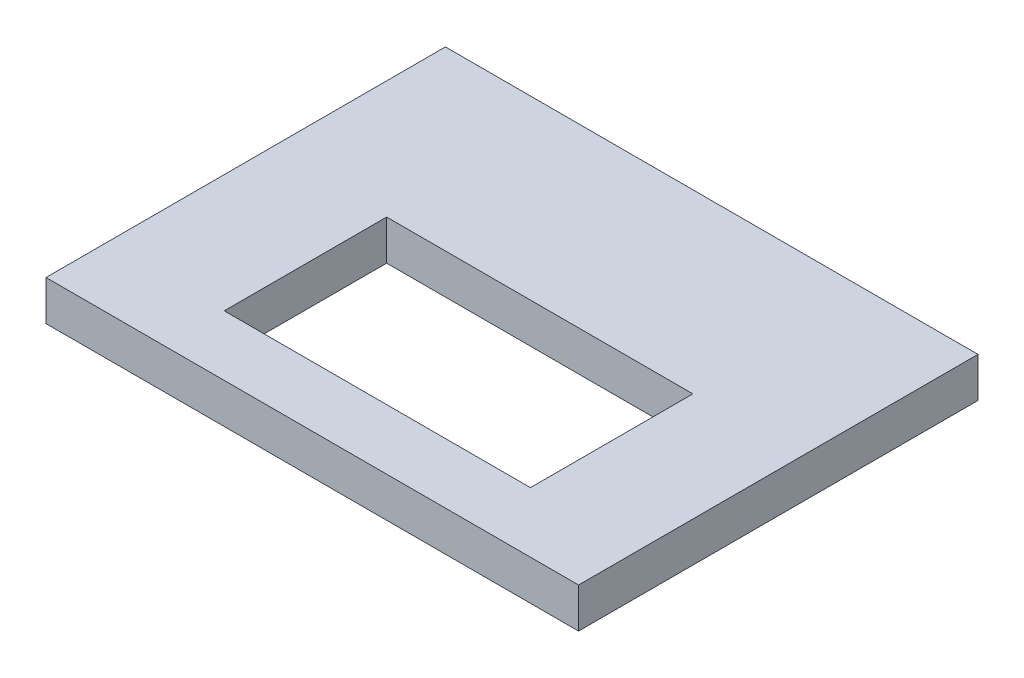
ISO-10303-21;
HEADER;
FILE_DESCRIPTION(('STEP AP214'),'2;1');
FILE_NAME('part.step','',(''),(''),'','','');
FILE_SCHEMA(('AUTOMOTIVE_DESIGN { 1 0 10303 214 1 1 1 1 }'));
ENDSEC;
DATA;
#1=APPLICATION_CONTEXT('core data for automotive mechanical design processes');
#2=APPLICATION_PROTOCOL_DEFINITION('international standard','automotive_design',2000,#1);
#3=PRODUCT_CONTEXT('',#1,'mechanical');
#4=PRODUCT('Part','Part','',(#3));
#5=PRODUCT_RELATED_PRODUCT_CATEGORY('part','',(#4));
#6=PRODUCT_DEFINITION_FORMATION('','',#4);
#7=PRODUCT_DEFINITION_CONTEXT('part definition',#1,'design');
#8=PRODUCT_DEFINITION('design','',#6,#7);
#9=PRODUCT_DEFINITION_SHAPE('','',#8);
#10=(LENGTH_UNIT() NAMED_UNIT(*) SI_UNIT(.MILLI.,.METRE.));
#11=(NAMED_UNIT(*) PLANE_ANGLE_UNIT() SI_UNIT($,.RADIAN.));
#12=(NAMED_UNIT(*) SI_UNIT($,.STERADIAN.) SOLID_ANGLE_UNIT());
#13=UNCERTAINTY_MEASURE_WITH_UNIT(LENGTH_MEASURE(1.E-05),#10,'distance_accuracy_value','');
#14=(GEOMETRIC_REPRESENTATION_CONTEXT(3) GLOBAL_UNCERTAINTY_ASSIGNED_CONTEXT((#13)) GLOBAL_UNIT_ASSIGNED_CONTEXT((#10,
#11,#12)) REPRESENTATION_CONTEXT('',''));
#15=CARTESIAN_POINT('',(0.,0.,0.));
#16=DIRECTION('',(0.,0.,1.));
#17=DIRECTION('',(1.,0.,0.));
#18=AXIS2_PLACEMENT_3D('',#15,#16,#17);
#19=CARTESIAN_POINT('',(0.,3.,0.));
#20=DIRECTION('',(0.,1.,0.));
#21=DIRECTION('',(0.,0.,1.));
#22=AXIS2_PLACEMENT_3D('',#19,#20,#21);
#23=PLANE('',#22);
#24=DIRECTION('',(0.,0.,1.));
#25=VECTOR('',#24,1.);
#26=CARTESIAN_POINT('',(-55.8757652811462,3.,-14.368398637138));
#27=LINE('',#26,#25);
#28=CARTESIAN_POINT('',(-55.8757652811462,3.,-14.368398637138));
#29=VERTEX_POINT('',#28);
#30=CARTESIAN_POINT('',(-55.8757652811462,3.,15.631601362862));
#31=VERTEX_POINT('',#30);
#32=EDGE_CURVE('E134',#29,#31,#27,.T.);
#33=ORIENTED_EDGE('',*,*,#32,.T.);
#34=DIRECTION('',(1.,0.,0.));
#35=VECTOR('',#34,1.);
#36=CARTESIAN_POINT('',(-55.8757652811462,3.,15.631601362862));
#37=LINE('',#36,#35);
#38=CARTESIAN_POINT('',(-15.8757652811462,3.,15.631601362862));
#39=VERTEX_POINT('',#38);
#40=EDGE_CURVE('E137',#31,#39,#37,.T.);
#41=ORIENTED_EDGE('',*,*,#40,.T.);
#42=DIRECTION('',(0.,0.,-1.));
#43=VECTOR('',#42,1.);
#44=CARTESIAN_POINT('',(-15.8757652811462,3.,-14.368398637138));
#45=LINE('',#44,#43);
#46=CARTESIAN_POINT('',(-15.8757652811462,3.,-14.368398637138));
#47=VERTEX_POINT('',#46);
#48=EDGE_CURVE('E140',#39,#47,#45,.T.);
#49=ORIENTED_EDGE('',*,*,#48,.T.);
#50=DIRECTION('',(-1.,0.,0.));
#51=VECTOR('',#50,1.);
#52=CARTESIAN_POINT('',(-55.8757652811462,3.,-14.368398637138));
#53=LINE('',#52,#51);
#54=EDGE_CURVE('E142',#47,#29,#53,.T.);
#55=ORIENTED_EDGE('',*,*,#54,.T.);
#56=EDGE_LOOP('',(#33,#41,#49,#55));
#57=FACE_BOUND('',#56,.T.);
#58=DIRECTION('',(1.,0.,0.));
#59=VECTOR('',#58,1.);
#60=CARTESIAN_POINT('',(-47.0150352058024,3.,11.1067887587507));
#61=LINE('',#60,#59);
#62=CARTESIAN_POINT('',(-47.0150352058024,3.,11.1067887587507));
#63=VERTEX_POINT('',#62);
#64=CARTESIAN_POINT('',(-24.0150352058024,3.,11.1067887587507));
#65=VERTEX_POINT('',#64);
#66=EDGE_CURVE('E106',#63,#65,#61,.T.);
#67=ORIENTED_EDGE('',*,*,#66,.F.);
#68=DIRECTION('',(0.,0.,1.));
#69=VECTOR('',#68,1.);
#70=CARTESIAN_POINT('',(-47.0150352058024,3.,-1.09321124124927));
#71=LINE('',#70,#69);
#72=CARTESIAN_POINT('',(-47.0150352058024,3.,-1.09321124124927));
#73=VERTEX_POINT('',#72);
#74=EDGE_CURVE('E98',#73,#63,#71,.T.);
#75=ORIENTED_EDGE('',*,*,#74,.F.);
#76=DIRECTION('',(-1.,0.,0.));
#77=VECTOR('',#76,1.);
#78=CARTESIAN_POINT('',(-47.0150352058024,3.,-1.09321124124927));
#79=LINE('',#78,#77);
#80=CARTESIAN_POINT('',(-24.0150352058024,3.,-1.09321124124927));
#81=VERTEX_POINT('',#80);
#82=EDGE_CURVE('E120',#81,#73,#79,.T.);
#83=ORIENTED_EDGE('',*,*,#82,.F.);
#84=DIRECTION('',(0.,0.,-1.));
#85=VECTOR('',#84,1.);
#86=CARTESIAN_POINT('',(-24.0150352058024,3.,-1.09321124124927));
#87=LINE('',#86,#85);
#88=EDGE_CURVE('E118',#65,#81,#87,.T.);
#89=ORIENTED_EDGE('',*,*,#88,.F.);
#90=EDGE_LOOP('',(#67,#75,#83,#89));
#91=FACE_BOUND('',#90,.T.);
#92=ADVANCED_FACE('F33',(#57,#91),#23,.T.);
#93=CARTESIAN_POINT('',(0.,0.,0.));
#94=DIRECTION('',(0.,1.,0.));
#95=DIRECTION('',(0.,0.,1.));
#96=AXIS2_PLACEMENT_3D('',#93,#94,#95);
#97=PLANE('',#96);
#98=DIRECTION('',(0.,0.,1.));
#99=VECTOR('',#98,1.);
#100=CARTESIAN_POINT('',(-55.8757652811462,0.,-14.368398637138));
#101=LINE('',#100,#99);
#102=CARTESIAN_POINT('',(-55.8757652811462,0.,-14.368398637138));
#103=VERTEX_POINT('',#102);
#104=CARTESIAN_POINT('',(-55.8757652811462,0.,15.631601362862));
#105=VERTEX_POINT('',#104);
#106=EDGE_CURVE('E114',#103,#105,#101,.T.);
#107=ORIENTED_EDGE('',*,*,#106,.F.);
#108=DIRECTION('',(-1.,0.,0.));
#109=VECTOR('',#108,1.);
#110=CARTESIAN_POINT('',(-55.8757652811462,0.,-14.368398637138));
#111=LINE('',#110,#109);
#112=CARTESIAN_POINT('',(-15.8757652811462,0.,-14.368398637138));
#113=VERTEX_POINT('',#112);
#114=EDGE_CURVE('E138',#113,#103,#111,.T.);
#115=ORIENTED_EDGE('',*,*,#114,.F.);
#116=DIRECTION('',(0.,0.,-1.));
#117=VECTOR('',#116,1.);
#118=CARTESIAN_POINT('',(-15.8757652811462,0.,-14.368398637138));
#119=LINE('',#118,#117);
#120=CARTESIAN_POINT('',(-15.8757652811462,0.,15.631601362862));
#121=VERTEX_POINT('',#120);
#122=EDGE_CURVE('E149',#121,#113,#119,.T.);
#123=ORIENTED_EDGE('',*,*,#122,.F.);
#124=DIRECTION('',(1.,0.,0.));
#125=VECTOR('',#124,1.);
#126=CARTESIAN_POINT('',(-55.8757652811462,0.,15.631601362862));
#127=LINE('',#126,#125);
#128=EDGE_CURVE('E147',#105,#121,#127,.T.);
#129=ORIENTED_EDGE('',*,*,#128,.F.);
#130=EDGE_LOOP('',(#107,#115,#123,#129));
#131=FACE_BOUND('',#130,.T.);
#132=DIRECTION('',(0.,0.,1.));
#133=VECTOR('',#132,1.);
#134=CARTESIAN_POINT('',(-47.0150352058024,0.,-1.09321124124927));
#135=LINE('',#134,#133);
#136=CARTESIAN_POINT('',(-47.0150352058024,0.,-1.09321124124927));
#137=VERTEX_POINT('',#136);
#138=CARTESIAN_POINT('',(-47.0150352058024,0.,11.1067887587507));
#139=VERTEX_POINT('',#138);
#140=EDGE_CURVE('E56',#137,#139,#135,.T.);
#141=ORIENTED_EDGE('',*,*,#140,.T.);
#142=DIRECTION('',(1.,0.,0.));
#143=VECTOR('',#142,1.);
#144=CARTESIAN_POINT('',(-47.0150352058024,0.,11.1067887587507));
#145=LINE('',#144,#143);
#146=CARTESIAN_POINT('',(-24.0150352058024,0.,11.1067887587507));
#147=VERTEX_POINT('',#146);
#148=EDGE_CURVE('E113',#139,#147,#145,.T.);
#149=ORIENTED_EDGE('',*,*,#148,.T.);
#150=DIRECTION('',(0.,0.,-1.));
#151=VECTOR('',#150,1.);
#152=CARTESIAN_POINT('',(-24.0150352058024,0.,-1.09321124124927));
#153=LINE('',#152,#151);
#154=CARTESIAN_POINT('',(-24.0150352058024,0.,-1.09321124124927));
#155=VERTEX_POINT('',#154);
#156=EDGE_CURVE('E126',#147,#155,#153,.T.);
#157=ORIENTED_EDGE('',*,*,#156,.T.);
#158=DIRECTION('',(-1.,0.,0.));
#159=VECTOR('',#158,1.);
#160=CARTESIAN_POINT('',(-47.0150352058024,0.,-1.09321124124927));
#161=LINE('',#160,#159);
#162=EDGE_CURVE('E107',#155,#137,#161,.T.);
#163=ORIENTED_EDGE('',*,*,#162,.T.);
#164=EDGE_LOOP('',(#141,#149,#157,#163));
#165=FACE_BOUND('',#164,.T.);
#166=ADVANCED_FACE('F167',(#131,#165),#97,.F.);
#167=CARTESIAN_POINT('',(-55.8757652811462,3.,-14.368398637138));
#168=DIRECTION('',(1.,0.,0.));
#169=DIRECTION('',(0.,0.,-1.));
#170=AXIS2_PLACEMENT_3D('',#167,#168,#169);
#171=PLANE('',#170);
#172=ORIENTED_EDGE('',*,*,#106,.T.);
#173=DIRECTION('',(0.,-1.,0.));
#174=VECTOR('',#173,1.);
#175=CARTESIAN_POINT('',(-55.8757652811462,3.,15.631601362862));
#176=LINE('',#175,#174);
#177=EDGE_CURVE('E11',#31,#105,#176,.T.);
#178=ORIENTED_EDGE('',*,*,#177,.F.);
#179=ORIENTED_EDGE('',*,*,#32,.F.);
#180=DIRECTION('',(0.,-1.,0.));
#181=VECTOR('',#180,1.);
#182=CARTESIAN_POINT('',(-55.8757652811462,3.,-14.368398637138));
#183=LINE('',#182,#181);
#184=EDGE_CURVE('E144',#29,#103,#183,.T.);
#185=ORIENTED_EDGE('',*,*,#184,.T.);
#186=EDGE_LOOP('',(#172,#178,#179,#185));
#187=FACE_BOUND('',#186,.T.);
#188=ADVANCED_FACE('F35',(#187),#171,.F.);
#189=CARTESIAN_POINT('',(-55.8757652811462,3.,15.631601362862));
#190=DIRECTION('',(0.,0.,-1.));
#191=DIRECTION('',(-1.,0.,0.));
#192=AXIS2_PLACEMENT_3D('',#189,#190,#191);
#193=PLANE('',#192);
#194=ORIENTED_EDGE('',*,*,#128,.T.);
#195=DIRECTION('',(0.,-1.,0.));
#196=VECTOR('',#195,1.);
#197=CARTESIAN_POINT('',(-15.8757652811462,3.,15.631601362862));
#198=LINE('',#197,#196);
#199=EDGE_CURVE('E41',#39,#121,#198,.T.);
#200=ORIENTED_EDGE('',*,*,#199,.F.);
#201=ORIENTED_EDGE('',*,*,#40,.F.);
#202=ORIENTED_EDGE('',*,*,#177,.T.);
#203=EDGE_LOOP('',(#194,#200,#201,#202));
#204=FACE_BOUND('',#203,.T.);
#205=ADVANCED_FACE('F177',(#204),#193,.F.);
#206=CARTESIAN_POINT('',(-15.8757652811462,3.,-14.368398637138));
#207=DIRECTION('',(-1.,0.,0.));
#208=DIRECTION('',(0.,0.,1.));
#209=AXIS2_PLACEMENT_3D('',#206,#207,#208);
#210=PLANE('',#209);
#211=ORIENTED_EDGE('',*,*,#122,.T.);
#212=DIRECTION('',(0.,-1.,0.));
#213=VECTOR('',#212,1.);
#214=CARTESIAN_POINT('',(-15.8757652811462,3.,-14.368398637138));
#215=LINE('',#214,#213);
#216=EDGE_CURVE('E154',#47,#113,#215,.T.);
#217=ORIENTED_EDGE('',*,*,#216,.F.);
#218=ORIENTED_EDGE('',*,*,#48,.F.);
#219=ORIENTED_EDGE('',*,*,#199,.T.);
#220=EDGE_LOOP('',(#211,#217,#218,#219));
#221=FACE_BOUND('',#220,.T.);
#222=ADVANCED_FACE('F161',(#221),#210,.F.);
#223=CARTESIAN_POINT('',(-55.8757652811462,3.,-14.368398637138));
#224=DIRECTION('',(0.,0.,1.));
#225=DIRECTION('',(1.,0.,0.));
#226=AXIS2_PLACEMENT_3D('',#223,#224,#225);
#227=PLANE('',#226);
#228=ORIENTED_EDGE('',*,*,#114,.T.);
#229=ORIENTED_EDGE('',*,*,#184,.F.);
#230=ORIENTED_EDGE('',*,*,#54,.F.);
#231=ORIENTED_EDGE('',*,*,#216,.T.);
#232=EDGE_LOOP('',(#228,#229,#230,#231));
#233=FACE_BOUND('',#232,.T.);
#234=ADVANCED_FACE('F171',(#233),#227,.F.);
#235=CARTESIAN_POINT('',(-47.0150352058024,3.,-1.09321124124927));
#236=DIRECTION('',(1.,0.,0.));
#237=DIRECTION('',(0.,0.,-1.));
#238=AXIS2_PLACEMENT_3D('',#235,#236,#237);
#239=PLANE('',#238);
#240=ORIENTED_EDGE('',*,*,#140,.F.);
#241=DIRECTION('',(0.,-1.,0.));
#242=VECTOR('',#241,1.);
#243=CARTESIAN_POINT('',(-47.0150352058024,3.,-1.09321124124927));
#244=LINE('',#243,#242);
#245=EDGE_CURVE('E102',#73,#137,#244,.T.);
#246=ORIENTED_EDGE('',*,*,#245,.F.);
#247=ORIENTED_EDGE('',*,*,#74,.T.);
#248=DIRECTION('',(0.,-1.,0.));
#249=VECTOR('',#248,1.);
#250=CARTESIAN_POINT('',(-47.0150352058024,3.,11.1067887587507));
#251=LINE('',#250,#249);
#252=EDGE_CURVE('E101',#63,#139,#251,.T.);
#253=ORIENTED_EDGE('',*,*,#252,.T.);
#254=EDGE_LOOP('',(#240,#246,#247,#253));
#255=FACE_BOUND('',#254,.T.);
#256=ADVANCED_FACE('F100',(#255),#239,.T.);
#257=CARTESIAN_POINT('',(-47.0150352058024,3.,11.1067887587507));
#258=DIRECTION('',(0.,0.,-1.));
#259=DIRECTION('',(-1.,0.,0.));
#260=AXIS2_PLACEMENT_3D('',#257,#258,#259);
#261=PLANE('',#260);
#262=ORIENTED_EDGE('',*,*,#148,.F.);
#263=ORIENTED_EDGE('',*,*,#252,.F.);
#264=ORIENTED_EDGE('',*,*,#66,.T.);
#265=DIRECTION('',(0.,-1.,0.));
#266=VECTOR('',#265,1.);
#267=CARTESIAN_POINT('',(-24.0150352058024,3.,11.1067887587507));
#268=LINE('',#267,#266);
#269=EDGE_CURVE('E115',#65,#147,#268,.T.);
#270=ORIENTED_EDGE('',*,*,#269,.T.);
#271=EDGE_LOOP('',(#262,#263,#264,#270));
#272=FACE_BOUND('',#271,.T.);
#273=ADVANCED_FACE('F110',(#272),#261,.T.);
#274=CARTESIAN_POINT('',(-24.0150352058024,3.,-1.09321124124927));
#275=DIRECTION('',(-1.,0.,0.));
#276=DIRECTION('',(0.,0.,1.));
#277=AXIS2_PLACEMENT_3D('',#274,#275,#276);
#278=PLANE('',#277);
#279=ORIENTED_EDGE('',*,*,#156,.F.);
#280=ORIENTED_EDGE('',*,*,#269,.F.);
#281=ORIENTED_EDGE('',*,*,#88,.T.);
#282=DIRECTION('',(0.,-1.,0.));
#283=VECTOR('',#282,1.);
#284=CARTESIAN_POINT('',(-24.0150352058024,3.,-1.09321124124927));
#285=LINE('',#284,#283);
#286=EDGE_CURVE('E48',#81,#155,#285,.T.);
#287=ORIENTED_EDGE('',*,*,#286,.T.);
#288=EDGE_LOOP('',(#279,#280,#281,#287));
#289=FACE_BOUND('',#288,.T.);
#290=ADVANCED_FACE('F200',(#289),#278,.T.);
#291=CARTESIAN_POINT('',(-47.0150352058024,3.,-1.09321124124927));
#292=DIRECTION('',(0.,0.,1.));
#293=DIRECTION('',(1.,0.,0.));
#294=AXIS2_PLACEMENT_3D('',#291,#292,#293);
#295=PLANE('',#294);
#296=ORIENTED_EDGE('',*,*,#162,.F.);
#297=ORIENTED_EDGE('',*,*,#286,.F.);
#298=ORIENTED_EDGE('',*,*,#82,.T.);
#299=ORIENTED_EDGE('',*,*,#245,.T.);
#300=EDGE_LOOP('',(#296,#297,#298,#299));
#301=FACE_BOUND('',#300,.T.);
#302=ADVANCED_FACE('F204',(#301),#295,.T.);
#303=CLOSED_SHELL('',(#92,#166,#188,#205,#222,#234,#256,#273,#290,#302));
#304=MANIFOLD_SOLID_BREP('B2',#303);
#305=ADVANCED_BREP_SHAPE_REPRESENTATION('',(#18,#304),#14);
#306=SHAPE_DEFINITION_REPRESENTATION(#9,#305);
ENDSEC;
END-ISO-10303-21;
